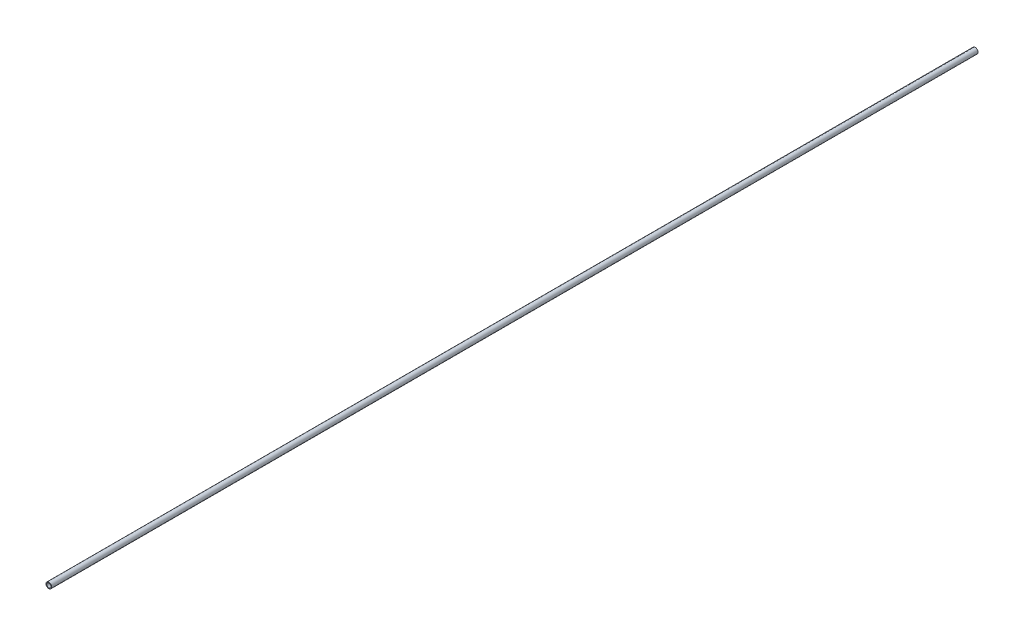
ISO-10303-21;
HEADER;
FILE_DESCRIPTION(('STEP AP214'),'2;1');
FILE_NAME('part.step','',(''),(''),'','','');
FILE_SCHEMA(('AUTOMOTIVE_DESIGN { 1 0 10303 214 1 1 1 1 }'));
ENDSEC;
DATA;
#1=APPLICATION_CONTEXT('core data for automotive mechanical design processes');
#2=APPLICATION_PROTOCOL_DEFINITION('international standard','automotive_design',2000,#1);
#3=PRODUCT_CONTEXT('',#1,'mechanical');
#4=PRODUCT('Part','Part','',(#3));
#5=PRODUCT_RELATED_PRODUCT_CATEGORY('part','',(#4));
#6=PRODUCT_DEFINITION_FORMATION('','',#4);
#7=PRODUCT_DEFINITION_CONTEXT('part definition',#1,'design');
#8=PRODUCT_DEFINITION('design','',#6,#7);
#9=PRODUCT_DEFINITION_SHAPE('','',#8);
#10=(LENGTH_UNIT() NAMED_UNIT(*) SI_UNIT(.MILLI.,.METRE.));
#11=(NAMED_UNIT(*) PLANE_ANGLE_UNIT() SI_UNIT($,.RADIAN.));
#12=(NAMED_UNIT(*) SI_UNIT($,.STERADIAN.) SOLID_ANGLE_UNIT());
#13=UNCERTAINTY_MEASURE_WITH_UNIT(LENGTH_MEASURE(1.E-05),#10,'distance_accuracy_value','');
#14=(GEOMETRIC_REPRESENTATION_CONTEXT(3) GLOBAL_UNCERTAINTY_ASSIGNED_CONTEXT((#13)) GLOBAL_UNIT_ASSIGNED_CONTEXT((#10,
#11,#12)) REPRESENTATION_CONTEXT('',''));
#15=CARTESIAN_POINT('',(0.,0.,0.));
#16=DIRECTION('',(0.,0.,1.));
#17=DIRECTION('',(1.,0.,0.));
#18=AXIS2_PLACEMENT_3D('',#15,#16,#17);
#19=CARTESIAN_POINT('',(0.,0.,1750.));
#20=DIRECTION('',(0.,0.,1.));
#21=DIRECTION('',(1.,0.,0.));
#22=AXIS2_PLACEMENT_3D('',#19,#20,#21);
#23=PLANE('',#22);
#24=CARTESIAN_POINT('',(0.,0.,1750.));
#25=DIRECTION('',(0.,0.,1.));
#26=DIRECTION('',(1.,0.,0.));
#27=AXIS2_PLACEMENT_3D('',#24,#25,#26);
#28=CIRCLE('',#27,10.668);
#29=CARTESIAN_POINT('',(10.668,0.,1750.));
#30=VERTEX_POINT('',#29);
#31=EDGE_CURVE('E11',#30,#30,#28,.T.);
#32=ORIENTED_EDGE('',*,*,#31,.T.);
#33=EDGE_LOOP('',(#32));
#34=FACE_BOUND('',#33,.T.);
#35=CARTESIAN_POINT('',(0.,0.,1750.));
#36=DIRECTION('',(0.,0.,1.));
#37=DIRECTION('',(1.,0.,0.));
#38=AXIS2_PLACEMENT_3D('',#35,#36,#37);
#39=CIRCLE('',#38,7.8994);
#40=CARTESIAN_POINT('',(7.8994,0.,1750.));
#41=VERTEX_POINT('',#40);
#42=EDGE_CURVE('E48',#41,#41,#39,.T.);
#43=ORIENTED_EDGE('',*,*,#42,.F.);
#44=EDGE_LOOP('',(#43));
#45=FACE_BOUND('',#44,.T.);
#46=ADVANCED_FACE('F37',(#34,#45),#23,.T.);
#47=CARTESIAN_POINT('',(0.,0.,-1750.));
#48=DIRECTION('',(0.,0.,1.));
#49=DIRECTION('',(1.,0.,0.));
#50=AXIS2_PLACEMENT_3D('',#47,#48,#49);
#51=PLANE('',#50);
#52=CARTESIAN_POINT('',(0.,0.,-1750.));
#53=DIRECTION('',(0.,0.,1.));
#54=DIRECTION('',(1.,0.,0.));
#55=AXIS2_PLACEMENT_3D('',#52,#53,#54);
#56=CIRCLE('',#55,10.668);
#57=CARTESIAN_POINT('',(10.668,0.,-1750.));
#58=VERTEX_POINT('',#57);
#59=EDGE_CURVE('E41',#58,#58,#56,.T.);
#60=ORIENTED_EDGE('',*,*,#59,.F.);
#61=EDGE_LOOP('',(#60));
#62=FACE_BOUND('',#61,.T.);
#63=CARTESIAN_POINT('',(0.,0.,-1750.));
#64=DIRECTION('',(0.,0.,1.));
#65=DIRECTION('',(1.,0.,0.));
#66=AXIS2_PLACEMENT_3D('',#63,#64,#65);
#67=CIRCLE('',#66,7.8994);
#68=CARTESIAN_POINT('',(7.8994,0.,-1750.));
#69=VERTEX_POINT('',#68);
#70=EDGE_CURVE('E50',#69,#69,#67,.T.);
#71=ORIENTED_EDGE('',*,*,#70,.T.);
#72=EDGE_LOOP('',(#71));
#73=FACE_BOUND('',#72,.T.);
#74=ADVANCED_FACE('F60',(#62,#73),#51,.F.);
#75=CARTESIAN_POINT('',(0.,0.,1750.));
#76=DIRECTION('',(0.,0.,-1.));
#77=DIRECTION('',(-1.,0.,0.));
#78=AXIS2_PLACEMENT_3D('',#75,#76,#77);
#79=CYLINDRICAL_SURFACE('',#78,10.668);
#80=ORIENTED_EDGE('',*,*,#31,.F.);
#81=EDGE_LOOP('',(#80));
#82=FACE_BOUND('',#81,.T.);
#83=ORIENTED_EDGE('',*,*,#59,.T.);
#84=EDGE_LOOP('',(#83));
#85=FACE_BOUND('',#84,.T.);
#86=ADVANCED_FACE('F39',(#82,#85),#79,.T.);
#87=CARTESIAN_POINT('',(0.,0.,1750.));
#88=DIRECTION('',(0.,0.,-1.));
#89=DIRECTION('',(-1.,0.,0.));
#90=AXIS2_PLACEMENT_3D('',#87,#88,#89);
#91=CYLINDRICAL_SURFACE('',#90,7.8994);
#92=ORIENTED_EDGE('',*,*,#42,.T.);
#93=EDGE_LOOP('',(#92));
#94=FACE_BOUND('',#93,.T.);
#95=ORIENTED_EDGE('',*,*,#70,.F.);
#96=EDGE_LOOP('',(#95));
#97=FACE_BOUND('',#96,.T.);
#98=ADVANCED_FACE('F56',(#94,#97),#91,.F.);
#99=CLOSED_SHELL('',(#46,#74,#86,#98));
#100=MANIFOLD_SOLID_BREP('B2',#99);
#101=ADVANCED_BREP_SHAPE_REPRESENTATION('',(#18,#100),#14);
#102=SHAPE_DEFINITION_REPRESENTATION(#9,#101);
ENDSEC;
END-ISO-10303-21;
